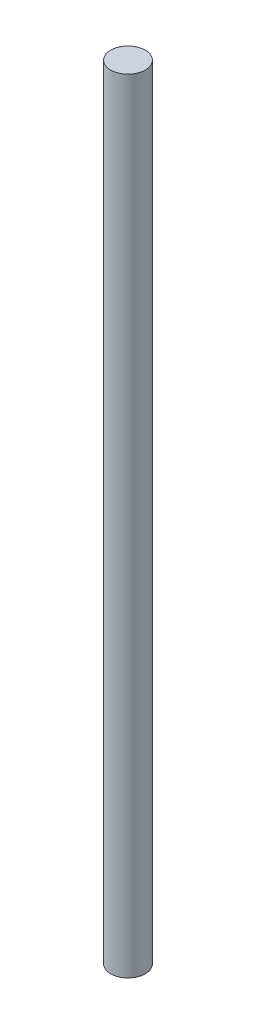
ISO-10303-21;
HEADER;
FILE_DESCRIPTION(('STEP AP214'),'2;1');
FILE_NAME('part.step','',(''),(''),'','','');
FILE_SCHEMA(('AUTOMOTIVE_DESIGN { 1 0 10303 214 1 1 1 1 }'));
ENDSEC;
DATA;
#1=APPLICATION_CONTEXT('core data for automotive mechanical design processes');
#2=APPLICATION_PROTOCOL_DEFINITION('international standard','automotive_design',2000,#1);
#3=PRODUCT_CONTEXT('',#1,'mechanical');
#4=PRODUCT('Part','Part','',(#3));
#5=PRODUCT_RELATED_PRODUCT_CATEGORY('part','',(#4));
#6=PRODUCT_DEFINITION_FORMATION('','',#4);
#7=PRODUCT_DEFINITION_CONTEXT('part definition',#1,'design');
#8=PRODUCT_DEFINITION('design','',#6,#7);
#9=PRODUCT_DEFINITION_SHAPE('','',#8);
#10=(LENGTH_UNIT() NAMED_UNIT(*) SI_UNIT(.MILLI.,.METRE.));
#11=(NAMED_UNIT(*) PLANE_ANGLE_UNIT() SI_UNIT($,.RADIAN.));
#12=(NAMED_UNIT(*) SI_UNIT($,.STERADIAN.) SOLID_ANGLE_UNIT());
#13=UNCERTAINTY_MEASURE_WITH_UNIT(LENGTH_MEASURE(1.E-05),#10,'distance_accuracy_value','');
#14=(GEOMETRIC_REPRESENTATION_CONTEXT(3) GLOBAL_UNCERTAINTY_ASSIGNED_CONTEXT((#13)) GLOBAL_UNIT_ASSIGNED_CONTEXT((#10,
#11,#12)) REPRESENTATION_CONTEXT('',''));
#15=CARTESIAN_POINT('',(0.,0.,0.));
#16=DIRECTION('',(0.,0.,1.));
#17=DIRECTION('',(1.,0.,0.));
#18=AXIS2_PLACEMENT_3D('',#15,#16,#17);
#19=CARTESIAN_POINT('',(0.,116.795002930309,0.));
#20=DIRECTION('',(0.,-1.,0.));
#21=DIRECTION('',(0.,0.,-1.));
#22=AXIS2_PLACEMENT_3D('',#19,#20,#21);
#23=CYLINDRICAL_SURFACE('',#22,1.5);
#24=CARTESIAN_POINT('',(0.,116.795002930309,0.));
#25=DIRECTION('',(0.,1.,0.));
#26=DIRECTION('',(0.,0.,1.));
#27=AXIS2_PLACEMENT_3D('',#24,#25,#26);
#28=CIRCLE('',#27,1.5);
#29=CARTESIAN_POINT('',(0.,116.795002930309,1.5));
#30=VERTEX_POINT('',#29);
#31=EDGE_CURVE('E10',#30,#30,#28,.T.);
#32=ORIENTED_EDGE('',*,*,#31,.F.);
#33=EDGE_LOOP('',(#32));
#34=FACE_BOUND('',#33,.T.);
#35=CARTESIAN_POINT('',(0.,48.7950029303088,0.));
#36=DIRECTION('',(0.,1.,0.));
#37=DIRECTION('',(0.,0.,1.));
#38=AXIS2_PLACEMENT_3D('',#35,#36,#37);
#39=CIRCLE('',#38,1.5);
#40=CARTESIAN_POINT('',(0.,48.7950029303088,1.5));
#41=VERTEX_POINT('',#40);
#42=EDGE_CURVE('E55',#41,#41,#39,.T.);
#43=ORIENTED_EDGE('',*,*,#42,.T.);
#44=EDGE_LOOP('',(#43));
#45=FACE_BOUND('',#44,.T.);
#46=ADVANCED_FACE('F48',(#34,#45),#23,.T.);
#47=CARTESIAN_POINT('',(0.,116.795002930309,0.));
#48=DIRECTION('',(0.,1.,0.));
#49=DIRECTION('',(0.,0.,1.));
#50=AXIS2_PLACEMENT_3D('',#47,#48,#49);
#51=PLANE('',#50);
#52=ORIENTED_EDGE('',*,*,#31,.T.);
#53=EDGE_LOOP('',(#52));
#54=FACE_BOUND('',#53,.T.);
#55=ADVANCED_FACE('F65',(#54),#51,.T.);
#56=CARTESIAN_POINT('',(0.,48.7950029303088,0.));
#57=DIRECTION('',(0.,1.,0.));
#58=DIRECTION('',(0.,0.,1.));
#59=AXIS2_PLACEMENT_3D('',#56,#57,#58);
#60=PLANE('',#59);
#61=ORIENTED_EDGE('',*,*,#42,.F.);
#62=EDGE_LOOP('',(#61));
#63=FACE_BOUND('',#62,.T.);
#64=ADVANCED_FACE('F63',(#63),#60,.F.);
#65=CLOSED_SHELL('',(#46,#55,#64));
#66=MANIFOLD_SOLID_BREP('B2',#65);
#67=ADVANCED_BREP_SHAPE_REPRESENTATION('',(#18,#66),#14);
#68=SHAPE_DEFINITION_REPRESENTATION(#9,#67);
ENDSEC;
END-ISO-10303-21;
